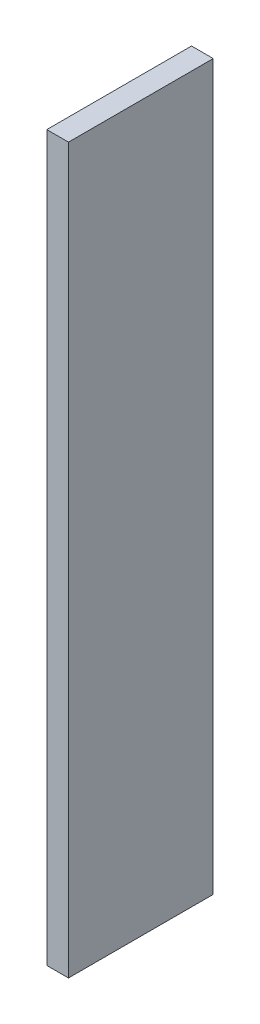
ISO-10303-21;
HEADER;
FILE_DESCRIPTION(('STEP AP214'),'2;1');
FILE_NAME('part.step','',(''),(''),'','','');
FILE_SCHEMA(('AUTOMOTIVE_DESIGN { 1 0 10303 214 1 1 1 1 }'));
ENDSEC;
DATA;
#1=APPLICATION_CONTEXT('core data for automotive mechanical design processes');
#2=APPLICATION_PROTOCOL_DEFINITION('international standard','automotive_design',2000,#1);
#3=PRODUCT_CONTEXT('',#1,'mechanical');
#4=PRODUCT('Part','Part','',(#3));
#5=PRODUCT_RELATED_PRODUCT_CATEGORY('part','',(#4));
#6=PRODUCT_DEFINITION_FORMATION('','',#4);
#7=PRODUCT_DEFINITION_CONTEXT('part definition',#1,'design');
#8=PRODUCT_DEFINITION('design','',#6,#7);
#9=PRODUCT_DEFINITION_SHAPE('','',#8);
#10=(LENGTH_UNIT() NAMED_UNIT(*) SI_UNIT(.MILLI.,.METRE.));
#11=(NAMED_UNIT(*) PLANE_ANGLE_UNIT() SI_UNIT($,.RADIAN.));
#12=(NAMED_UNIT(*) SI_UNIT($,.STERADIAN.) SOLID_ANGLE_UNIT());
#13=UNCERTAINTY_MEASURE_WITH_UNIT(LENGTH_MEASURE(1.E-05),#10,'distance_accuracy_value','');
#14=(GEOMETRIC_REPRESENTATION_CONTEXT(3) GLOBAL_UNCERTAINTY_ASSIGNED_CONTEXT((#13)) GLOBAL_UNIT_ASSIGNED_CONTEXT((#10,
#11,#12)) REPRESENTATION_CONTEXT('',''));
#15=CARTESIAN_POINT('',(0.,0.,0.));
#16=DIRECTION('',(0.,0.,1.));
#17=DIRECTION('',(1.,0.,0.));
#18=AXIS2_PLACEMENT_3D('',#15,#16,#17);
#19=CARTESIAN_POINT('',(3.,-50.,-10.));
#20=DIRECTION('',(0.,0.,1.));
#21=DIRECTION('',(1.,0.,0.));
#22=AXIS2_PLACEMENT_3D('',#19,#20,#21);
#23=PLANE('',#22);
#24=DIRECTION('',(0.,1.,0.));
#25=VECTOR('',#24,1.);
#26=CARTESIAN_POINT('',(0.,-50.,-10.));
#27=LINE('',#26,#25);
#28=CARTESIAN_POINT('',(0.,-50.,-10.));
#29=VERTEX_POINT('',#28);
#30=CARTESIAN_POINT('',(0.,50.,-10.));
#31=VERTEX_POINT('',#30);
#32=EDGE_CURVE('E96',#29,#31,#27,.T.);
#33=ORIENTED_EDGE('',*,*,#32,.T.);
#34=DIRECTION('',(-1.,0.,0.));
#35=VECTOR('',#34,1.);
#36=CARTESIAN_POINT('',(3.,50.,-10.));
#37=LINE('',#36,#35);
#38=CARTESIAN_POINT('',(3.,50.,-10.));
#39=VERTEX_POINT('',#38);
#40=EDGE_CURVE('E11',#39,#31,#37,.T.);
#41=ORIENTED_EDGE('',*,*,#40,.F.);
#42=DIRECTION('',(0.,1.,0.));
#43=VECTOR('',#42,1.);
#44=CARTESIAN_POINT('',(3.,-50.,-10.));
#45=LINE('',#44,#43);
#46=CARTESIAN_POINT('',(3.,-50.,-10.));
#47=VERTEX_POINT('',#46);
#48=EDGE_CURVE('E84',#47,#39,#45,.T.);
#49=ORIENTED_EDGE('',*,*,#48,.F.);
#50=DIRECTION('',(-1.,0.,0.));
#51=VECTOR('',#50,1.);
#52=CARTESIAN_POINT('',(3.,-50.,-10.));
#53=LINE('',#52,#51);
#54=EDGE_CURVE('E92',#47,#29,#53,.T.);
#55=ORIENTED_EDGE('',*,*,#54,.T.);
#56=EDGE_LOOP('',(#33,#41,#49,#55));
#57=FACE_BOUND('',#56,.T.);
#58=ADVANCED_FACE('F33',(#57),#23,.F.);
#59=CARTESIAN_POINT('',(3.,50.,10.));
#60=DIRECTION('',(0.,-1.,0.));
#61=DIRECTION('',(0.,0.,-1.));
#62=AXIS2_PLACEMENT_3D('',#59,#60,#61);
#63=PLANE('',#62);
#64=DIRECTION('',(0.,0.,1.));
#65=VECTOR('',#64,1.);
#66=CARTESIAN_POINT('',(0.,50.,10.));
#67=LINE('',#66,#65);
#68=CARTESIAN_POINT('',(0.,50.,10.));
#69=VERTEX_POINT('',#68);
#70=EDGE_CURVE('E88',#31,#69,#67,.T.);
#71=ORIENTED_EDGE('',*,*,#70,.T.);
#72=DIRECTION('',(-1.,0.,0.));
#73=VECTOR('',#72,1.);
#74=CARTESIAN_POINT('',(3.,50.,10.));
#75=LINE('',#74,#73);
#76=CARTESIAN_POINT('',(3.,50.,10.));
#77=VERTEX_POINT('',#76);
#78=EDGE_CURVE('E41',#77,#69,#75,.T.);
#79=ORIENTED_EDGE('',*,*,#78,.F.);
#80=DIRECTION('',(0.,0.,1.));
#81=VECTOR('',#80,1.);
#82=CARTESIAN_POINT('',(3.,50.,10.));
#83=LINE('',#82,#81);
#84=EDGE_CURVE('E79',#39,#77,#83,.T.);
#85=ORIENTED_EDGE('',*,*,#84,.F.);
#86=ORIENTED_EDGE('',*,*,#40,.T.);
#87=EDGE_LOOP('',(#71,#79,#85,#86));
#88=FACE_BOUND('',#87,.T.);
#89=ADVANCED_FACE('F87',(#88),#63,.F.);
#90=CARTESIAN_POINT('',(3.,-50.,10.));
#91=DIRECTION('',(0.,0.,-1.));
#92=DIRECTION('',(-1.,0.,0.));
#93=AXIS2_PLACEMENT_3D('',#90,#91,#92);
#94=PLANE('',#93);
#95=DIRECTION('',(0.,-1.,0.));
#96=VECTOR('',#95,1.);
#97=CARTESIAN_POINT('',(0.,-50.,10.));
#98=LINE('',#97,#96);
#99=CARTESIAN_POINT('',(0.,-50.,10.));
#100=VERTEX_POINT('',#99);
#101=EDGE_CURVE('E66',#69,#100,#98,.T.);
#102=ORIENTED_EDGE('',*,*,#101,.T.);
#103=DIRECTION('',(-1.,0.,0.));
#104=VECTOR('',#103,1.);
#105=CARTESIAN_POINT('',(3.,-50.,10.));
#106=LINE('',#105,#104);
#107=CARTESIAN_POINT('',(3.,-50.,10.));
#108=VERTEX_POINT('',#107);
#109=EDGE_CURVE('E89',#108,#100,#106,.T.);
#110=ORIENTED_EDGE('',*,*,#109,.F.);
#111=DIRECTION('',(0.,-1.,0.));
#112=VECTOR('',#111,1.);
#113=CARTESIAN_POINT('',(3.,-50.,10.));
#114=LINE('',#113,#112);
#115=EDGE_CURVE('E82',#77,#108,#114,.T.);
#116=ORIENTED_EDGE('',*,*,#115,.F.);
#117=ORIENTED_EDGE('',*,*,#78,.T.);
#118=EDGE_LOOP('',(#102,#110,#116,#117));
#119=FACE_BOUND('',#118,.T.);
#120=ADVANCED_FACE('F90',(#119),#94,.F.);
#121=CARTESIAN_POINT('',(3.,-50.,10.));
#122=DIRECTION('',(0.,1.,0.));
#123=DIRECTION('',(0.,0.,1.));
#124=AXIS2_PLACEMENT_3D('',#121,#122,#123);
#125=PLANE('',#124);
#126=DIRECTION('',(0.,0.,-1.));
#127=VECTOR('',#126,1.);
#128=CARTESIAN_POINT('',(0.,-50.,10.));
#129=LINE('',#128,#127);
#130=EDGE_CURVE('E72',#100,#29,#129,.T.);
#131=ORIENTED_EDGE('',*,*,#130,.T.);
#132=ORIENTED_EDGE('',*,*,#54,.F.);
#133=DIRECTION('',(0.,0.,-1.));
#134=VECTOR('',#133,1.);
#135=CARTESIAN_POINT('',(3.,-50.,10.));
#136=LINE('',#135,#134);
#137=EDGE_CURVE('E49',#108,#47,#136,.T.);
#138=ORIENTED_EDGE('',*,*,#137,.F.);
#139=ORIENTED_EDGE('',*,*,#109,.T.);
#140=EDGE_LOOP('',(#131,#132,#138,#139));
#141=FACE_BOUND('',#140,.T.);
#142=ADVANCED_FACE('F103',(#141),#125,.F.);
#143=CARTESIAN_POINT('',(3.,0.,0.));
#144=DIRECTION('',(-1.,0.,0.));
#145=DIRECTION('',(0.,0.,1.));
#146=AXIS2_PLACEMENT_3D('',#143,#144,#145);
#147=PLANE('',#146);
#148=ORIENTED_EDGE('',*,*,#48,.T.);
#149=ORIENTED_EDGE('',*,*,#84,.T.);
#150=ORIENTED_EDGE('',*,*,#115,.T.);
#151=ORIENTED_EDGE('',*,*,#137,.T.);
#152=EDGE_LOOP('',(#148,#149,#150,#151));
#153=FACE_BOUND('',#152,.T.);
#154=ADVANCED_FACE('F80',(#153),#147,.F.);
#155=CARTESIAN_POINT('',(0.,0.,0.));
#156=DIRECTION('',(-1.,0.,0.));
#157=DIRECTION('',(0.,0.,1.));
#158=AXIS2_PLACEMENT_3D('',#155,#156,#157);
#159=PLANE('',#158);
#160=ORIENTED_EDGE('',*,*,#32,.F.);
#161=ORIENTED_EDGE('',*,*,#130,.F.);
#162=ORIENTED_EDGE('',*,*,#101,.F.);
#163=ORIENTED_EDGE('',*,*,#70,.F.);
#164=EDGE_LOOP('',(#160,#161,#162,#163));
#165=FACE_BOUND('',#164,.T.);
#166=ADVANCED_FACE('F106',(#165),#159,.T.);
#167=CLOSED_SHELL('',(#58,#89,#120,#142,#154,#166));
#168=MANIFOLD_SOLID_BREP('B2',#167);
#169=ADVANCED_BREP_SHAPE_REPRESENTATION('',(#18,#168),#14);
#170=SHAPE_DEFINITION_REPRESENTATION(#9,#169);
ENDSEC;
END-ISO-10303-21;
